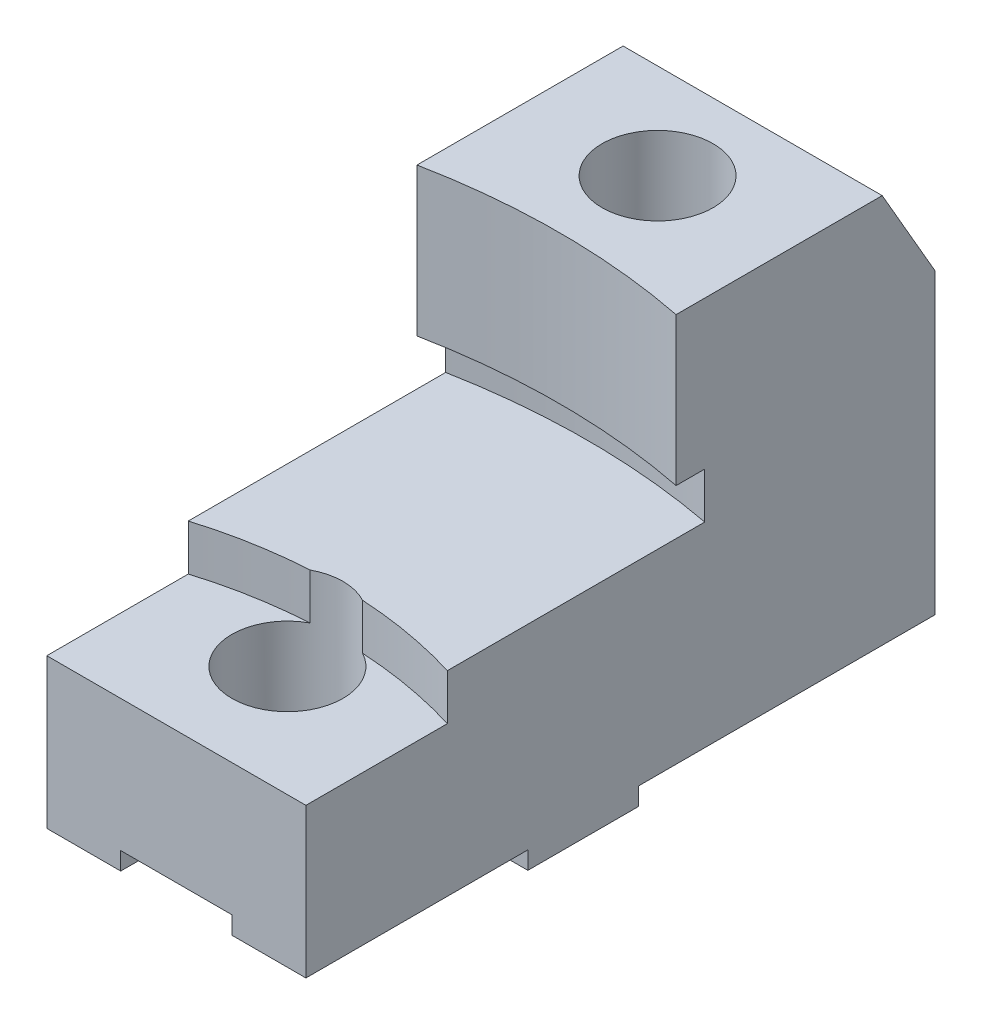
ISO-10303-21;
HEADER;
FILE_DESCRIPTION(('STEP AP214'),'2;1');
FILE_NAME('part.step','',(''),(''),'','','');
FILE_SCHEMA(('AUTOMOTIVE_DESIGN { 1 0 10303 214 1 1 1 1 }'));
ENDSEC;
DATA;
#1=APPLICATION_CONTEXT('core data for automotive mechanical design processes');
#2=APPLICATION_PROTOCOL_DEFINITION('international standard','automotive_design',2000,#1);
#3=PRODUCT_CONTEXT('',#1,'mechanical');
#4=PRODUCT('Part','Part','',(#3));
#5=PRODUCT_RELATED_PRODUCT_CATEGORY('part','',(#4));
#6=PRODUCT_DEFINITION_FORMATION('','',#4);
#7=PRODUCT_DEFINITION_CONTEXT('part definition',#1,'design');
#8=PRODUCT_DEFINITION('design','',#6,#7);
#9=PRODUCT_DEFINITION_SHAPE('','',#8);
#10=(LENGTH_UNIT() NAMED_UNIT(*) SI_UNIT(.MILLI.,.METRE.));
#11=(NAMED_UNIT(*) PLANE_ANGLE_UNIT() SI_UNIT($,.RADIAN.));
#12=(NAMED_UNIT(*) SI_UNIT($,.STERADIAN.) SOLID_ANGLE_UNIT());
#13=UNCERTAINTY_MEASURE_WITH_UNIT(LENGTH_MEASURE(1.E-05),#10,'distance_accuracy_value','');
#14=(GEOMETRIC_REPRESENTATION_CONTEXT(3) GLOBAL_UNCERTAINTY_ASSIGNED_CONTEXT((#13)) GLOBAL_UNIT_ASSIGNED_CONTEXT((#10,
#11,#12)) REPRESENTATION_CONTEXT('',''));
#15=CARTESIAN_POINT('',(0.,0.,0.));
#16=DIRECTION('',(0.,0.,1.));
#17=DIRECTION('',(1.,0.,0.));
#18=AXIS2_PLACEMENT_3D('',#15,#16,#17);
#19=CARTESIAN_POINT('',(-0.587019268774248,1.13,3.99193187619467));
#20=DIRECTION('',(0.,1.,0.));
#21=DIRECTION('',(0.,0.,1.));
#22=AXIS2_PLACEMENT_3D('',#19,#20,#21);
#23=CYLINDRICAL_SURFACE('',#22,3.);
#24=DIRECTION('',(0.,1.,0.));
#25=VECTOR('',#24,1.);
#26=CARTESIAN_POINT('',(-0.763885676302914,1.535,0.997150035410954));
#27=LINE('',#26,#25);
#28=CARTESIAN_POINT('',(-0.763885676302913,1.44,0.997150035410953));
#29=VERTEX_POINT('',#28);
#30=CARTESIAN_POINT('',(-0.763885676302914,1.13,0.997150035410953));
#31=VERTEX_POINT('',#30);
#32=EDGE_CURVE('E48',#29,#31,#27,.F.);
#33=ORIENTED_EDGE('',*,*,#32,.F.);
#34=CARTESIAN_POINT('',(-0.587019268774248,1.44,3.99193187619467));
#35=DIRECTION('',(0.,1.,0.));
#36=DIRECTION('',(0.,0.,1.));
#37=AXIS2_PLACEMENT_3D('',#34,#35,#36);
#38=CIRCLE('',#37,3.);
#39=CARTESIAN_POINT('',(-1.46201926877425,1.44,1.12237180538242));
#40=VERTEX_POINT('',#39);
#41=EDGE_CURVE('E465',#40,#29,#38,.F.);
#42=ORIENTED_EDGE('',*,*,#41,.F.);
#43=DIRECTION('',(0.,1.,0.));
#44=VECTOR('',#43,1.);
#45=CARTESIAN_POINT('',(-1.46201926877425,1.13,1.12237180538242));
#46=LINE('',#45,#44);
#47=CARTESIAN_POINT('',(-1.46201926877425,1.13,1.12237180538242));
#48=VERTEX_POINT('',#47);
#49=EDGE_CURVE('E402',#48,#40,#46,.T.);
#50=ORIENTED_EDGE('',*,*,#49,.F.);
#51=CARTESIAN_POINT('',(-0.587019268774248,1.13,3.99193187619467));
#52=DIRECTION('',(0.,1.,0.));
#53=DIRECTION('',(0.,0.,1.));
#54=AXIS2_PLACEMENT_3D('',#51,#52,#53);
#55=CIRCLE('',#54,3.);
#56=EDGE_CURVE('E404',#48,#31,#55,.F.);
#57=ORIENTED_EDGE('',*,*,#56,.T.);
#58=EDGE_LOOP('',(#33,#42,#50,#57));
#59=FACE_BOUND('',#58,.T.);
#60=ADVANCED_FACE('F26',(#59),#23,.F.);
#61=CARTESIAN_POINT('',(-1.46201926877425,2.75,-2.17217901955773));
#62=DIRECTION('',(1.,0.,0.));
#63=DIRECTION('',(0.,0.,-1.));
#64=AXIS2_PLACEMENT_3D('',#61,#62,#63);
#65=PLANE('',#64);
#66=DIRECTION('',(0.,0.,1.));
#67=VECTOR('',#66,1.);
#68=CARTESIAN_POINT('',(-1.46201926877425,2.75,-2.17217901955773));
#69=LINE('',#68,#67);
#70=CARTESIAN_POINT('',(-1.46201926877425,2.75,-1.81422185266017));
#71=VERTEX_POINT('',#70);
#72=CARTESIAN_POINT('',(-1.46201926877425,2.75,-0.42217901955773));
#73=VERTEX_POINT('',#72);
#74=EDGE_CURVE('E205',#71,#73,#69,.T.);
#75=ORIENTED_EDGE('',*,*,#74,.F.);
#76=DIRECTION('',(0.,0.866025403784442,0.499999999999995));
#77=VECTOR('',#76,1.);
#78=CARTESIAN_POINT('',(-1.46201926877425,-1.96376111831199,-4.53571310321315));
#79=LINE('',#78,#77);
#80=CARTESIAN_POINT('',(-1.46201926877425,2.13,-2.17217901955773));
#81=VERTEX_POINT('',#80);
#82=EDGE_CURVE('E41',#81,#71,#79,.T.);
#83=ORIENTED_EDGE('',*,*,#82,.F.);
#84=DIRECTION('',(0.,-1.,0.));
#85=VECTOR('',#84,1.);
#86=CARTESIAN_POINT('',(-1.46201926877425,2.75,-2.17217901955773));
#87=LINE('',#86,#85);
#88=CARTESIAN_POINT('',(-1.46201926877425,0.12,-2.17217901955773));
#89=VERTEX_POINT('',#88);
#90=EDGE_CURVE('E202',#81,#89,#87,.T.);
#91=ORIENTED_EDGE('',*,*,#90,.T.);
#92=DIRECTION('',(0.,0.,-1.));
#93=VECTOR('',#92,1.);
#94=CARTESIAN_POINT('',(-1.46201926877425,0.12,-2.17217901955773));
#95=LINE('',#94,#93);
#96=CARTESIAN_POINT('',(-1.46201926877425,0.12,-0.16967901955773));
#97=VERTEX_POINT('',#96);
#98=EDGE_CURVE('E272',#97,#89,#95,.T.);
#99=ORIENTED_EDGE('',*,*,#98,.F.);
#100=DIRECTION('',(0.,1.,0.));
#101=VECTOR('',#100,1.);
#102=CARTESIAN_POINT('',(-1.46201926877425,0.12,-0.16967901955773));
#103=LINE('',#102,#101);
#104=CARTESIAN_POINT('',(-1.46201926877425,0.,-0.16967901955773));
#105=VERTEX_POINT('',#104);
#106=EDGE_CURVE('E269',#105,#97,#103,.T.);
#107=ORIENTED_EDGE('',*,*,#106,.F.);
#108=DIRECTION('',(0.,0.,1.));
#109=VECTOR('',#108,1.);
#110=CARTESIAN_POINT('',(-1.46201926877425,0.,-2.17217901955773));
#111=LINE('',#110,#109);
#112=CARTESIAN_POINT('',(-1.46201926877425,0.,0.57882098044227));
#113=VERTEX_POINT('',#112);
#114=EDGE_CURVE('E287',#105,#113,#111,.T.);
#115=ORIENTED_EDGE('',*,*,#114,.T.);
#116=DIRECTION('',(0.,-1.,0.));
#117=VECTOR('',#116,1.);
#118=CARTESIAN_POINT('',(-1.46201926877425,0.12,0.57882098044227));
#119=LINE('',#118,#117);
#120=CARTESIAN_POINT('',(-1.46201926877425,0.12,0.57882098044227));
#121=VERTEX_POINT('',#120);
#122=EDGE_CURVE('E361',#121,#113,#119,.T.);
#123=ORIENTED_EDGE('',*,*,#122,.F.);
#124=DIRECTION('',(0.,0.,-1.));
#125=VECTOR('',#124,1.);
#126=CARTESIAN_POINT('',(-1.46201926877425,0.12,0.57882098044227));
#127=LINE('',#126,#125);
#128=CARTESIAN_POINT('',(-1.46201926877425,0.12,2.07782098044227));
#129=VERTEX_POINT('',#128);
#130=EDGE_CURVE('E254',#129,#121,#127,.T.);
#131=ORIENTED_EDGE('',*,*,#130,.F.);
#132=DIRECTION('',(0.,-1.,0.));
#133=VECTOR('',#132,1.);
#134=CARTESIAN_POINT('',(-1.46201926877425,2.75,2.07782098044227));
#135=LINE('',#134,#133);
#136=CARTESIAN_POINT('',(-1.46201926877425,1.13,2.07782098044227));
#137=VERTEX_POINT('',#136);
#138=EDGE_CURVE('E222',#137,#129,#135,.T.);
#139=ORIENTED_EDGE('',*,*,#138,.F.);
#140=DIRECTION('',(0.,0.,-1.));
#141=VECTOR('',#140,1.);
#142=CARTESIAN_POINT('',(-1.46201926877425,1.13,0.689876428318467));
#143=LINE('',#142,#141);
#144=EDGE_CURVE('E400',#137,#48,#143,.T.);
#145=ORIENTED_EDGE('',*,*,#144,.T.);
#146=ORIENTED_EDGE('',*,*,#49,.T.);
#147=DIRECTION('',(0.,0.,-1.));
#148=VECTOR('',#147,1.);
#149=CARTESIAN_POINT('',(-1.46201926877425,1.44,-3.76360037579504));
#150=LINE('',#149,#148);
#151=CARTESIAN_POINT('',(-1.46201926877425,1.44,-0.615722082166358));
#152=VERTEX_POINT('',#151);
#153=EDGE_CURVE('E315',#40,#152,#150,.T.);
#154=ORIENTED_EDGE('',*,*,#153,.T.);
#155=DIRECTION('',(0.,1.,0.));
#156=VECTOR('',#155,1.);
#157=CARTESIAN_POINT('',(-1.46201926877425,1.44,-0.615722082166358));
#158=LINE('',#157,#156);
#159=CARTESIAN_POINT('',(-1.46201926877425,1.75,-0.615722082166358));
#160=VERTEX_POINT('',#159);
#161=EDGE_CURVE('E317',#152,#160,#158,.T.);
#162=ORIENTED_EDGE('',*,*,#161,.T.);
#163=DIRECTION('',(0.,0.,1.));
#164=VECTOR('',#163,1.);
#165=CARTESIAN_POINT('',(-1.46201926877425,1.75,-0.615722082166358));
#166=LINE('',#165,#164);
#167=CARTESIAN_POINT('',(-1.46201926877425,1.75,-0.42217901955773));
#168=VERTEX_POINT('',#167);
#169=EDGE_CURVE('E303',#160,#168,#166,.T.);
#170=ORIENTED_EDGE('',*,*,#169,.T.);
#171=DIRECTION('',(0.,1.,0.));
#172=VECTOR('',#171,1.);
#173=CARTESIAN_POINT('',(-1.46201926877425,1.44,-0.42217901955773));
#174=LINE('',#173,#172);
#175=EDGE_CURVE('E301',#168,#73,#174,.T.);
#176=ORIENTED_EDGE('',*,*,#175,.T.);
#177=EDGE_LOOP('',(#75,#83,#91,#99,#107,#115,#123,#131,#139,#145,#146,#154,#162,#170,#176));
#178=FACE_BOUND('',#177,.T.);
#179=ADVANCED_FACE('F28',(#178),#65,.F.);
#180=CARTESIAN_POINT('',(-1.46201926877425,2.75,2.07782098044227));
#181=DIRECTION('',(0.,0.,-1.));
#182=DIRECTION('',(-1.,0.,0.));
#183=AXIS2_PLACEMENT_3D('',#180,#181,#182);
#184=PLANE('',#183);
#185=DIRECTION('',(-1.,0.,0.));
#186=VECTOR('',#185,1.);
#187=CARTESIAN_POINT('',(-3.28082705599017,1.13,2.07782098044227));
#188=LINE('',#187,#186);
#189=CARTESIAN_POINT('',(0.287980731225752,1.13,2.07782098044227));
#190=VERTEX_POINT('',#189);
#191=EDGE_CURVE('E398',#190,#137,#188,.T.);
#192=ORIENTED_EDGE('',*,*,#191,.T.);
#193=ORIENTED_EDGE('',*,*,#138,.T.);
#194=DIRECTION('',(-1.,0.,0.));
#195=VECTOR('',#194,1.);
#196=CARTESIAN_POINT('',(1.28798073122575,0.12,2.07782098044227));
#197=LINE('',#196,#195);
#198=CARTESIAN_POINT('',(-0.962769268774248,0.12,2.07782098044227));
#199=VERTEX_POINT('',#198);
#200=EDGE_CURVE('E262',#199,#129,#197,.T.);
#201=ORIENTED_EDGE('',*,*,#200,.F.);
#202=DIRECTION('',(0.,-1.,0.));
#203=VECTOR('',#202,1.);
#204=CARTESIAN_POINT('',(-0.962769268774248,0.24,2.07782098044227));
#205=LINE('',#204,#203);
#206=CARTESIAN_POINT('',(-0.962769268774248,0.24,2.07782098044227));
#207=VERTEX_POINT('',#206);
#208=EDGE_CURVE('E306',#207,#199,#205,.T.);
#209=ORIENTED_EDGE('',*,*,#208,.F.);
#210=DIRECTION('',(-1.,0.,0.));
#211=VECTOR('',#210,1.);
#212=CARTESIAN_POINT('',(-0.962769268774248,0.24,2.07782098044227));
#213=LINE('',#212,#211);
#214=CARTESIAN_POINT('',(-0.211269268774247,0.24,2.07782098044227));
#215=VERTEX_POINT('',#214);
#216=EDGE_CURVE('E326',#215,#207,#213,.T.);
#217=ORIENTED_EDGE('',*,*,#216,.F.);
#218=DIRECTION('',(0.,1.,0.));
#219=VECTOR('',#218,1.);
#220=CARTESIAN_POINT('',(-0.211269268774247,0.24,2.07782098044227));
#221=LINE('',#220,#219);
#222=CARTESIAN_POINT('',(-0.211269268774247,0.12,2.07782098044227));
#223=VERTEX_POINT('',#222);
#224=EDGE_CURVE('E324',#223,#215,#221,.T.);
#225=ORIENTED_EDGE('',*,*,#224,.F.);
#226=CARTESIAN_POINT('',(0.287980731225752,0.12,2.07782098044227));
#227=VERTEX_POINT('',#226);
#228=EDGE_CURVE('E257',#227,#223,#197,.T.);
#229=ORIENTED_EDGE('',*,*,#228,.F.);
#230=DIRECTION('',(0.,-1.,0.));
#231=VECTOR('',#230,1.);
#232=CARTESIAN_POINT('',(0.287980731225752,2.75,2.07782098044227));
#233=LINE('',#232,#231);
#234=EDGE_CURVE('E215',#190,#227,#233,.T.);
#235=ORIENTED_EDGE('',*,*,#234,.F.);
#236=EDGE_LOOP('',(#192,#193,#201,#209,#217,#225,#229,#235));
#237=FACE_BOUND('',#236,.T.);
#238=ADVANCED_FACE('F382',(#237),#184,.F.);
#239=CARTESIAN_POINT('',(0.287980731225752,2.75,-2.17217901955773));
#240=DIRECTION('',(-1.,0.,0.));
#241=DIRECTION('',(0.,0.,1.));
#242=AXIS2_PLACEMENT_3D('',#239,#240,#241);
#243=PLANE('',#242);
#244=DIRECTION('',(0.,-1.,0.));
#245=VECTOR('',#244,1.);
#246=CARTESIAN_POINT('',(0.287980731225752,2.75,-2.17217901955773));
#247=LINE('',#246,#245);
#248=CARTESIAN_POINT('',(0.287980731225752,2.13,-2.17217901955773));
#249=VERTEX_POINT('',#248);
#250=CARTESIAN_POINT('',(0.287980731225752,0.12,-2.17217901955773));
#251=VERTEX_POINT('',#250);
#252=EDGE_CURVE('E212',#249,#251,#247,.T.);
#253=ORIENTED_EDGE('',*,*,#252,.F.);
#254=DIRECTION('',(0.,0.866025403784442,0.499999999999995));
#255=VECTOR('',#254,1.);
#256=CARTESIAN_POINT('',(0.287980731225752,-1.96376111831199,-4.53571310321315));
#257=LINE('',#256,#255);
#258=CARTESIAN_POINT('',(0.287980731225752,2.75,-1.81422185266017));
#259=VERTEX_POINT('',#258);
#260=EDGE_CURVE('E193',#249,#259,#257,.T.);
#261=ORIENTED_EDGE('',*,*,#260,.T.);
#262=DIRECTION('',(0.,0.,-1.));
#263=VECTOR('',#262,1.);
#264=CARTESIAN_POINT('',(0.287980731225752,2.75,-2.17217901955773));
#265=LINE('',#264,#263);
#266=CARTESIAN_POINT('',(0.287980731225752,2.75,-0.42217901955773));
#267=VERTEX_POINT('',#266);
#268=EDGE_CURVE('E213',#267,#259,#265,.T.);
#269=ORIENTED_EDGE('',*,*,#268,.F.);
#270=DIRECTION('',(0.,1.,0.));
#271=VECTOR('',#270,1.);
#272=CARTESIAN_POINT('',(0.287980731225752,1.44,-0.42217901955773));
#273=LINE('',#272,#271);
#274=CARTESIAN_POINT('',(0.287980731225751,1.75,-0.422179019557729));
#275=VERTEX_POINT('',#274);
#276=EDGE_CURVE('E307',#275,#267,#273,.T.);
#277=ORIENTED_EDGE('',*,*,#276,.F.);
#278=DIRECTION('',(0.,0.,-1.));
#279=VECTOR('',#278,1.);
#280=CARTESIAN_POINT('',(0.287980731225752,1.75,-0.615722082166359));
#281=LINE('',#280,#279);
#282=CARTESIAN_POINT('',(0.287980731225752,1.75,-0.615722082166359));
#283=VERTEX_POINT('',#282);
#284=EDGE_CURVE('E419',#275,#283,#281,.T.);
#285=ORIENTED_EDGE('',*,*,#284,.T.);
#286=DIRECTION('',(0.,1.,0.));
#287=VECTOR('',#286,1.);
#288=CARTESIAN_POINT('',(0.287980731225752,1.44,-0.615722082166359));
#289=LINE('',#288,#287);
#290=CARTESIAN_POINT('',(0.287980731225752,1.44,-0.615722082166359));
#291=VERTEX_POINT('',#290);
#292=EDGE_CURVE('E312',#291,#283,#289,.T.);
#293=ORIENTED_EDGE('',*,*,#292,.F.);
#294=DIRECTION('',(0.,0.,1.));
#295=VECTOR('',#294,1.);
#296=CARTESIAN_POINT('',(0.287980731225752,1.44,-3.76360037579504));
#297=LINE('',#296,#295);
#298=CARTESIAN_POINT('',(0.287980731225752,1.44,1.12237180538242));
#299=VERTEX_POINT('',#298);
#300=EDGE_CURVE('E311',#291,#299,#297,.T.);
#301=ORIENTED_EDGE('',*,*,#300,.T.);
#302=DIRECTION('',(0.,1.,0.));
#303=VECTOR('',#302,1.);
#304=CARTESIAN_POINT('',(0.287980731225752,1.13,1.12237180538242));
#305=LINE('',#304,#303);
#306=CARTESIAN_POINT('',(0.287980731225752,1.13,1.12237180538242));
#307=VERTEX_POINT('',#306);
#308=EDGE_CURVE('E408',#307,#299,#305,.T.);
#309=ORIENTED_EDGE('',*,*,#308,.F.);
#310=DIRECTION('',(0.,0.,1.));
#311=VECTOR('',#310,1.);
#312=CARTESIAN_POINT('',(0.287980731225752,1.13,0.689876428318467));
#313=LINE('',#312,#311);
#314=EDGE_CURVE('E397',#307,#190,#313,.T.);
#315=ORIENTED_EDGE('',*,*,#314,.T.);
#316=ORIENTED_EDGE('',*,*,#234,.T.);
#317=DIRECTION('',(0.,0.,-1.));
#318=VECTOR('',#317,1.);
#319=CARTESIAN_POINT('',(0.287980731225752,0.12,-2.17217901955773));
#320=LINE('',#319,#318);
#321=CARTESIAN_POINT('',(0.287980731225752,0.12,0.57882098044227));
#322=VERTEX_POINT('',#321);
#323=EDGE_CURVE('E232',#227,#322,#320,.T.);
#324=ORIENTED_EDGE('',*,*,#323,.T.);
#325=DIRECTION('',(0.,-1.,0.));
#326=VECTOR('',#325,1.);
#327=CARTESIAN_POINT('',(0.287980731225752,2.75,0.57882098044227));
#328=LINE('',#327,#326);
#329=CARTESIAN_POINT('',(0.287980731225752,0.,0.57882098044227));
#330=VERTEX_POINT('',#329);
#331=EDGE_CURVE('E260',#322,#330,#328,.T.);
#332=ORIENTED_EDGE('',*,*,#331,.T.);
#333=DIRECTION('',(0.,0.,-1.));
#334=VECTOR('',#333,1.);
#335=CARTESIAN_POINT('',(0.287980731225752,0.,-2.17217901955773));
#336=LINE('',#335,#334);
#337=CARTESIAN_POINT('',(0.287980731225752,0.,-0.16967901955773));
#338=VERTEX_POINT('',#337);
#339=EDGE_CURVE('E290',#330,#338,#336,.T.);
#340=ORIENTED_EDGE('',*,*,#339,.T.);
#341=DIRECTION('',(0.,1.,0.));
#342=VECTOR('',#341,1.);
#343=CARTESIAN_POINT('',(0.287980731225752,2.75,-0.16967901955773));
#344=LINE('',#343,#342);
#345=CARTESIAN_POINT('',(0.287980731225752,0.12,-0.16967901955773));
#346=VERTEX_POINT('',#345);
#347=EDGE_CURVE('E278',#338,#346,#344,.T.);
#348=ORIENTED_EDGE('',*,*,#347,.T.);
#349=DIRECTION('',(0.,0.,-1.));
#350=VECTOR('',#349,1.);
#351=CARTESIAN_POINT('',(0.287980731225752,0.12,-2.17217901955773));
#352=LINE('',#351,#350);
#353=EDGE_CURVE('E284',#346,#251,#352,.T.);
#354=ORIENTED_EDGE('',*,*,#353,.T.);
#355=EDGE_LOOP('',(#253,#261,#269,#277,#285,#293,#301,#309,#315,#316,#324,#332,#340,#348,#354));
#356=FACE_BOUND('',#355,.T.);
#357=ADVANCED_FACE('F392',(#356),#243,.F.);
#358=CARTESIAN_POINT('',(-0.587019268774248,1.44,-3.76360037579504));
#359=DIRECTION('',(0.,-1.,0.));
#360=DIRECTION('',(0.,0.,-1.));
#361=AXIS2_PLACEMENT_3D('',#358,#359,#360);
#362=PLANE('',#361);
#363=ORIENTED_EDGE('',*,*,#41,.T.);
#364=CARTESIAN_POINT('',(-0.587019268774248,1.44,1.32782098044227));
#365=DIRECTION('',(0.,-1.,0.));
#366=DIRECTION('',(0.,0.,-1.));
#367=AXIS2_PLACEMENT_3D('',#364,#365,#366);
#368=CIRCLE('',#367,0.375);
#369=CARTESIAN_POINT('',(-0.410152861245582,1.44,0.997150035410953));
#370=VERTEX_POINT('',#369);
#371=EDGE_CURVE('E461',#29,#370,#368,.T.);
#372=ORIENTED_EDGE('',*,*,#371,.T.);
#373=EDGE_CURVE('E464',#370,#299,#38,.F.);
#374=ORIENTED_EDGE('',*,*,#373,.T.);
#375=ORIENTED_EDGE('',*,*,#300,.F.);
#376=CARTESIAN_POINT('',(-0.587019268774248,1.44,3.99193187619466));
#377=DIRECTION('',(0.,1.,0.));
#378=DIRECTION('',(0.,0.,-1.));
#379=AXIS2_PLACEMENT_3D('',#376,#377,#378);
#380=CIRCLE('',#379,4.69);
#381=EDGE_CURVE('E422',#291,#152,#380,.T.);
#382=ORIENTED_EDGE('',*,*,#381,.T.);
#383=ORIENTED_EDGE('',*,*,#153,.F.);
#384=EDGE_LOOP('',(#363,#372,#374,#375,#382,#383));
#385=FACE_BOUND('',#384,.T.);
#386=ADVANCED_FACE('F477',(#385),#362,.F.);
#387=CARTESIAN_POINT('',(-0.587019268774248,1.44,3.99193187619466));
#388=DIRECTION('',(0.,1.,0.));
#389=DIRECTION('',(0.,0.,1.));
#390=AXIS2_PLACEMENT_3D('',#387,#388,#389);
#391=CYLINDRICAL_SURFACE('',#390,4.5);
#392=CARTESIAN_POINT('',(-0.587019268774248,1.75,3.99193187619485));
#393=DIRECTION('',(0.,-1.,0.));
#394=DIRECTION('',(0.,0.,-1.));
#395=AXIS2_PLACEMENT_3D('',#392,#393,#394);
#396=CIRCLE('',#395,4.50000000000018);
#397=EDGE_CURVE('E417',#168,#275,#396,.T.);
#398=ORIENTED_EDGE('',*,*,#397,.T.);
#399=ORIENTED_EDGE('',*,*,#276,.T.);
#400=CARTESIAN_POINT('',(-0.587019268774248,2.75,3.99193187619466));
#401=DIRECTION('',(0.,-1.,0.));
#402=DIRECTION('',(0.,0.,-1.));
#403=AXIS2_PLACEMENT_3D('',#400,#401,#402);
#404=CIRCLE('',#403,4.5);
#405=EDGE_CURVE('E297',#267,#73,#404,.F.);
#406=ORIENTED_EDGE('',*,*,#405,.T.);
#407=ORIENTED_EDGE('',*,*,#175,.F.);
#408=EDGE_LOOP('',(#398,#399,#406,#407));
#409=FACE_BOUND('',#408,.T.);
#410=ADVANCED_FACE('F309',(#409),#391,.F.);
#411=CARTESIAN_POINT('',(-1.46201926877425,0.,2.07782098044227));
#412=DIRECTION('',(0.,1.,0.));
#413=DIRECTION('',(0.,0.,1.));
#414=AXIS2_PLACEMENT_3D('',#411,#412,#413);
#415=PLANE('',#414);
#416=DIRECTION('',(1.,0.,0.));
#417=VECTOR('',#416,1.);
#418=CARTESIAN_POINT('',(-1.46201926877425,0.,-0.16967901955773));
#419=LINE('',#418,#417);
#420=CARTESIAN_POINT('',(-0.962769268774248,0.,-0.16967901955773));
#421=VERTEX_POINT('',#420);
#422=EDGE_CURVE('E225',#105,#421,#419,.T.);
#423=ORIENTED_EDGE('',*,*,#422,.T.);
#424=DIRECTION('',(0.,0.,1.));
#425=VECTOR('',#424,1.);
#426=CARTESIAN_POINT('',(-0.962769268774248,0.,-2.17217901955773));
#427=LINE('',#426,#425);
#428=CARTESIAN_POINT('',(-0.962769268774248,0.,0.57882098044227));
#429=VERTEX_POINT('',#428);
#430=EDGE_CURVE('E337',#421,#429,#427,.T.);
#431=ORIENTED_EDGE('',*,*,#430,.T.);
#432=DIRECTION('',(-1.,0.,0.));
#433=VECTOR('',#432,1.);
#434=CARTESIAN_POINT('',(-1.46201926877425,0.,0.57882098044227));
#435=LINE('',#434,#433);
#436=EDGE_CURVE('E228',#429,#113,#435,.T.);
#437=ORIENTED_EDGE('',*,*,#436,.T.);
#438=ORIENTED_EDGE('',*,*,#114,.F.);
#439=EDGE_LOOP('',(#423,#431,#437,#438));
#440=FACE_BOUND('',#439,.T.);
#441=ADVANCED_FACE('F369',(#440),#415,.F.);
#442=CARTESIAN_POINT('',(1.28798073122575,0.12,-2.17217901955773));
#443=DIRECTION('',(0.,1.,0.));
#444=DIRECTION('',(0.,0.,1.));
#445=AXIS2_PLACEMENT_3D('',#442,#443,#444);
#446=PLANE('',#445);
#447=DIRECTION('',(-1.,0.,0.));
#448=VECTOR('',#447,1.);
#449=CARTESIAN_POINT('',(1.28798073122575,0.12,-2.17217901955773));
#450=LINE('',#449,#448);
#451=CARTESIAN_POINT('',(-0.962769268774248,0.12,-2.17217901955773));
#452=VERTEX_POINT('',#451);
#453=EDGE_CURVE('E210',#452,#89,#450,.T.);
#454=ORIENTED_EDGE('',*,*,#453,.F.);
#455=DIRECTION('',(0.,0.,1.));
#456=VECTOR('',#455,1.);
#457=CARTESIAN_POINT('',(-0.962769268774247,0.12,-2.17217901955773));
#458=LINE('',#457,#456);
#459=CARTESIAN_POINT('',(-0.962769268774247,0.12,-0.16967901955773));
#460=VERTEX_POINT('',#459);
#461=EDGE_CURVE('E359',#452,#460,#458,.T.);
#462=ORIENTED_EDGE('',*,*,#461,.T.);
#463=DIRECTION('',(-1.,0.,0.));
#464=VECTOR('',#463,1.);
#465=CARTESIAN_POINT('',(1.28798073122575,0.12,-0.16967901955773));
#466=LINE('',#465,#464);
#467=EDGE_CURVE('E274',#460,#97,#466,.T.);
#468=ORIENTED_EDGE('',*,*,#467,.T.);
#469=ORIENTED_EDGE('',*,*,#98,.T.);
#470=EDGE_LOOP('',(#454,#462,#468,#469));
#471=FACE_BOUND('',#470,.T.);
#472=ADVANCED_FACE('F376',(#471),#446,.F.);
#473=CARTESIAN_POINT('',(1.28798073122575,0.12,-0.16967901955773));
#474=DIRECTION('',(0.,0.,1.));
#475=DIRECTION('',(1.,0.,0.));
#476=AXIS2_PLACEMENT_3D('',#473,#474,#475);
#477=PLANE('',#476);
#478=ORIENTED_EDGE('',*,*,#467,.F.);
#479=DIRECTION('',(0.,-1.,0.));
#480=VECTOR('',#479,1.);
#481=CARTESIAN_POINT('',(-0.962769268774247,0.12,-0.16967901955773));
#482=LINE('',#481,#480);
#483=EDGE_CURVE('E356',#460,#421,#482,.T.);
#484=ORIENTED_EDGE('',*,*,#483,.T.);
#485=ORIENTED_EDGE('',*,*,#422,.F.);
#486=ORIENTED_EDGE('',*,*,#106,.T.);
#487=EDGE_LOOP('',(#478,#484,#485,#486));
#488=FACE_BOUND('',#487,.T.);
#489=ADVANCED_FACE('F374',(#488),#477,.F.);
#490=CARTESIAN_POINT('',(1.28798073122575,0.12,0.57882098044227));
#491=DIRECTION('',(0.,1.,0.));
#492=DIRECTION('',(0.,0.,1.));
#493=AXIS2_PLACEMENT_3D('',#490,#491,#492);
#494=PLANE('',#493);
#495=DIRECTION('',(-1.,0.,0.));
#496=VECTOR('',#495,1.);
#497=CARTESIAN_POINT('',(1.28798073122575,0.12,0.57882098044227));
#498=LINE('',#497,#496);
#499=CARTESIAN_POINT('',(-0.962769268774247,0.12,0.57882098044227));
#500=VERTEX_POINT('',#499);
#501=EDGE_CURVE('E243',#500,#121,#498,.T.);
#502=ORIENTED_EDGE('',*,*,#501,.F.);
#503=DIRECTION('',(0.,0.,1.));
#504=VECTOR('',#503,1.);
#505=CARTESIAN_POINT('',(-0.962769268774247,0.12,0.57882098044227));
#506=LINE('',#505,#504);
#507=EDGE_CURVE('E251',#500,#199,#506,.T.);
#508=ORIENTED_EDGE('',*,*,#507,.T.);
#509=ORIENTED_EDGE('',*,*,#200,.T.);
#510=ORIENTED_EDGE('',*,*,#130,.T.);
#511=EDGE_LOOP('',(#502,#508,#509,#510));
#512=FACE_BOUND('',#511,.T.);
#513=ADVANCED_FACE('F249',(#512),#494,.F.);
#514=CARTESIAN_POINT('',(1.28798073122575,0.12,0.57882098044227));
#515=DIRECTION('',(0.,0.,-1.));
#516=DIRECTION('',(-1.,0.,0.));
#517=AXIS2_PLACEMENT_3D('',#514,#515,#516);
#518=PLANE('',#517);
#519=ORIENTED_EDGE('',*,*,#436,.F.);
#520=DIRECTION('',(0.,1.,0.));
#521=VECTOR('',#520,1.);
#522=CARTESIAN_POINT('',(-0.962769268774247,0.12,0.57882098044227));
#523=LINE('',#522,#521);
#524=EDGE_CURVE('E34',#429,#500,#523,.T.);
#525=ORIENTED_EDGE('',*,*,#524,.T.);
#526=ORIENTED_EDGE('',*,*,#501,.T.);
#527=ORIENTED_EDGE('',*,*,#122,.T.);
#528=EDGE_LOOP('',(#519,#525,#526,#527));
#529=FACE_BOUND('',#528,.T.);
#530=ADVANCED_FACE('F241',(#529),#518,.F.);
#531=CARTESIAN_POINT('',(-1.46201926877425,2.75,-2.17217901955773));
#532=DIRECTION('',(0.,0.,1.));
#533=DIRECTION('',(1.,0.,0.));
#534=AXIS2_PLACEMENT_3D('',#531,#532,#533);
#535=PLANE('',#534);
#536=ORIENTED_EDGE('',*,*,#90,.F.);
#537=DIRECTION('',(-1.,0.,0.));
#538=VECTOR('',#537,1.);
#539=CARTESIAN_POINT('',(0.287980731225752,2.13,-2.17217901955773));
#540=LINE('',#539,#538);
#541=EDGE_CURVE('E190',#249,#81,#540,.T.);
#542=ORIENTED_EDGE('',*,*,#541,.F.);
#543=ORIENTED_EDGE('',*,*,#252,.T.);
#544=CARTESIAN_POINT('',(-0.211269268774247,0.12,-2.17217901955773));
#545=VERTEX_POINT('',#544);
#546=EDGE_CURVE('E275',#251,#545,#450,.T.);
#547=ORIENTED_EDGE('',*,*,#546,.T.);
#548=DIRECTION('',(0.,1.,0.));
#549=VECTOR('',#548,1.);
#550=CARTESIAN_POINT('',(-0.211269268774247,0.24,-2.17217901955773));
#551=LINE('',#550,#549);
#552=CARTESIAN_POINT('',(-0.211269268774247,0.24,-2.17217901955773));
#553=VERTEX_POINT('',#552);
#554=EDGE_CURVE('E331',#545,#553,#551,.T.);
#555=ORIENTED_EDGE('',*,*,#554,.T.);
#556=DIRECTION('',(-1.,0.,0.));
#557=VECTOR('',#556,1.);
#558=CARTESIAN_POINT('',(-0.962769268774248,0.24,-2.17217901955773));
#559=LINE('',#558,#557);
#560=CARTESIAN_POINT('',(-0.962769268774248,0.24,-2.17217901955773));
#561=VERTEX_POINT('',#560);
#562=EDGE_CURVE('E334',#553,#561,#559,.T.);
#563=ORIENTED_EDGE('',*,*,#562,.T.);
#564=DIRECTION('',(0.,-1.,0.));
#565=VECTOR('',#564,1.);
#566=CARTESIAN_POINT('',(-0.962769268774248,0.24,-2.17217901955773));
#567=LINE('',#566,#565);
#568=EDGE_CURVE('E329',#561,#452,#567,.T.);
#569=ORIENTED_EDGE('',*,*,#568,.T.);
#570=ORIENTED_EDGE('',*,*,#453,.T.);
#571=EDGE_LOOP('',(#536,#542,#543,#547,#555,#563,#569,#570));
#572=FACE_BOUND('',#571,.T.);
#573=ADVANCED_FACE('F207',(#572),#535,.F.);
#574=CARTESIAN_POINT('',(-1.46201926877425,2.75,2.07782098044227));
#575=DIRECTION('',(0.,1.,0.));
#576=DIRECTION('',(0.,0.,1.));
#577=AXIS2_PLACEMENT_3D('',#574,#575,#576);
#578=PLANE('',#577);
#579=DIRECTION('',(-1.,0.,0.));
#580=VECTOR('',#579,1.);
#581=CARTESIAN_POINT('',(0.287980731225752,2.75,-1.81422185266017));
#582=LINE('',#581,#580);
#583=EDGE_CURVE('E197',#259,#71,#582,.T.);
#584=ORIENTED_EDGE('',*,*,#583,.T.);
#585=ORIENTED_EDGE('',*,*,#74,.T.);
#586=ORIENTED_EDGE('',*,*,#405,.F.);
#587=ORIENTED_EDGE('',*,*,#268,.T.);
#588=EDGE_LOOP('',(#584,#585,#586,#587));
#589=FACE_BOUND('',#588,.T.);
#590=CARTESIAN_POINT('',(-0.587019268774248,2.75,-1.17217901955773));
#591=DIRECTION('',(0.,1.,0.));
#592=DIRECTION('',(0.,0.,1.));
#593=AXIS2_PLACEMENT_3D('',#590,#591,#592);
#594=CIRCLE('',#593,0.375);
#595=CARTESIAN_POINT('',(-0.587019268774248,2.75,-0.79717901955773));
#596=VERTEX_POINT('',#595);
#597=EDGE_CURVE('E443',#596,#596,#594,.T.);
#598=ORIENTED_EDGE('',*,*,#597,.F.);
#599=EDGE_LOOP('',(#598));
#600=FACE_BOUND('',#599,.T.);
#601=ADVANCED_FACE('F294',(#589,#600),#578,.T.);
#602=CARTESIAN_POINT('',(-0.211269268774247,0.,0.57882098044227));
#603=VERTEX_POINT('',#602);
#604=EDGE_CURVE('E229',#330,#603,#435,.T.);
#605=ORIENTED_EDGE('',*,*,#604,.T.);
#606=DIRECTION('',(0.,0.,1.));
#607=VECTOR('',#606,1.);
#608=CARTESIAN_POINT('',(-0.211269268774247,0.,-2.17217901955773));
#609=LINE('',#608,#607);
#610=CARTESIAN_POINT('',(-0.211269268774247,0.,-0.16967901955773));
#611=VERTEX_POINT('',#610);
#612=EDGE_CURVE('E344',#611,#603,#609,.T.);
#613=ORIENTED_EDGE('',*,*,#612,.F.);
#614=EDGE_CURVE('E224',#611,#338,#419,.T.);
#615=ORIENTED_EDGE('',*,*,#614,.T.);
#616=ORIENTED_EDGE('',*,*,#339,.F.);
#617=EDGE_LOOP('',(#605,#613,#615,#616));
#618=FACE_BOUND('',#617,.T.);
#619=ADVANCED_FACE('F519',(#618),#415,.F.);
#620=CARTESIAN_POINT('',(-0.211269268774247,0.12,-0.16967901955773));
#621=VERTEX_POINT('',#620);
#622=EDGE_CURVE('E279',#346,#621,#466,.T.);
#623=ORIENTED_EDGE('',*,*,#622,.T.);
#624=DIRECTION('',(0.,0.,-1.));
#625=VECTOR('',#624,1.);
#626=CARTESIAN_POINT('',(-0.211269268774247,0.12,-2.17217901955773));
#627=LINE('',#626,#625);
#628=EDGE_CURVE('E352',#621,#545,#627,.T.);
#629=ORIENTED_EDGE('',*,*,#628,.T.);
#630=ORIENTED_EDGE('',*,*,#546,.F.);
#631=ORIENTED_EDGE('',*,*,#353,.F.);
#632=EDGE_LOOP('',(#623,#629,#630,#631));
#633=FACE_BOUND('',#632,.T.);
#634=ADVANCED_FACE('F516',(#633),#446,.F.);
#635=ORIENTED_EDGE('',*,*,#614,.F.);
#636=DIRECTION('',(0.,1.,0.));
#637=VECTOR('',#636,1.);
#638=CARTESIAN_POINT('',(-0.211269268774247,0.12,-0.16967901955773));
#639=LINE('',#638,#637);
#640=EDGE_CURVE('E349',#611,#621,#639,.T.);
#641=ORIENTED_EDGE('',*,*,#640,.T.);
#642=ORIENTED_EDGE('',*,*,#622,.F.);
#643=ORIENTED_EDGE('',*,*,#347,.F.);
#644=EDGE_LOOP('',(#635,#641,#642,#643));
#645=FACE_BOUND('',#644,.T.);
#646=ADVANCED_FACE('F512',(#645),#477,.F.);
#647=ORIENTED_EDGE('',*,*,#228,.T.);
#648=DIRECTION('',(0.,0.,-1.));
#649=VECTOR('',#648,1.);
#650=CARTESIAN_POINT('',(-0.211269268774247,0.12,0.57882098044227));
#651=LINE('',#650,#649);
#652=CARTESIAN_POINT('',(-0.211269268774247,0.12,0.57882098044227));
#653=VERTEX_POINT('',#652);
#654=EDGE_CURVE('E340',#223,#653,#651,.T.);
#655=ORIENTED_EDGE('',*,*,#654,.T.);
#656=EDGE_CURVE('E256',#322,#653,#498,.T.);
#657=ORIENTED_EDGE('',*,*,#656,.F.);
#658=ORIENTED_EDGE('',*,*,#323,.F.);
#659=EDGE_LOOP('',(#647,#655,#657,#658));
#660=FACE_BOUND('',#659,.T.);
#661=ADVANCED_FACE('F389',(#660),#494,.F.);
#662=ORIENTED_EDGE('',*,*,#656,.T.);
#663=DIRECTION('',(0.,-1.,0.));
#664=VECTOR('',#663,1.);
#665=CARTESIAN_POINT('',(-0.211269268774247,0.12,0.57882098044227));
#666=LINE('',#665,#664);
#667=EDGE_CURVE('E235',#653,#603,#666,.T.);
#668=ORIENTED_EDGE('',*,*,#667,.T.);
#669=ORIENTED_EDGE('',*,*,#604,.F.);
#670=ORIENTED_EDGE('',*,*,#331,.F.);
#671=EDGE_LOOP('',(#662,#668,#669,#670));
#672=FACE_BOUND('',#671,.T.);
#673=ADVANCED_FACE('F509',(#672),#518,.F.);
#674=CARTESIAN_POINT('',(-0.962769268774248,0.24,-2.17217901955773));
#675=DIRECTION('',(-1.,0.,0.));
#676=DIRECTION('',(0.,0.,1.));
#677=AXIS2_PLACEMENT_3D('',#674,#675,#676);
#678=PLANE('',#677);
#679=ORIENTED_EDGE('',*,*,#568,.F.);
#680=DIRECTION('',(0.,0.,1.));
#681=VECTOR('',#680,1.);
#682=CARTESIAN_POINT('',(-0.962769268774248,0.24,-2.17217901955773));
#683=LINE('',#682,#681);
#684=EDGE_CURVE('E338',#561,#207,#683,.T.);
#685=ORIENTED_EDGE('',*,*,#684,.T.);
#686=ORIENTED_EDGE('',*,*,#208,.T.);
#687=ORIENTED_EDGE('',*,*,#507,.F.);
#688=ORIENTED_EDGE('',*,*,#524,.F.);
#689=ORIENTED_EDGE('',*,*,#430,.F.);
#690=ORIENTED_EDGE('',*,*,#483,.F.);
#691=ORIENTED_EDGE('',*,*,#461,.F.);
#692=EDGE_LOOP('',(#679,#685,#686,#687,#688,#689,#690,#691));
#693=FACE_BOUND('',#692,.T.);
#694=ADVANCED_FACE('F371',(#693),#678,.F.);
#695=CARTESIAN_POINT('',(-0.211269268774247,0.24,-2.17217901955773));
#696=DIRECTION('',(1.,0.,0.));
#697=DIRECTION('',(0.,0.,-1.));
#698=AXIS2_PLACEMENT_3D('',#695,#696,#697);
#699=PLANE('',#698);
#700=ORIENTED_EDGE('',*,*,#640,.F.);
#701=ORIENTED_EDGE('',*,*,#612,.T.);
#702=ORIENTED_EDGE('',*,*,#667,.F.);
#703=ORIENTED_EDGE('',*,*,#654,.F.);
#704=ORIENTED_EDGE('',*,*,#224,.T.);
#705=DIRECTION('',(0.,0.,1.));
#706=VECTOR('',#705,1.);
#707=CARTESIAN_POINT('',(-0.211269268774247,0.24,-2.17217901955773));
#708=LINE('',#707,#706);
#709=EDGE_CURVE('E341',#553,#215,#708,.T.);
#710=ORIENTED_EDGE('',*,*,#709,.F.);
#711=ORIENTED_EDGE('',*,*,#554,.F.);
#712=ORIENTED_EDGE('',*,*,#628,.F.);
#713=EDGE_LOOP('',(#700,#701,#702,#703,#704,#710,#711,#712));
#714=FACE_BOUND('',#713,.T.);
#715=ADVANCED_FACE('F503',(#714),#699,.F.);
#716=CARTESIAN_POINT('',(-0.962769268774248,0.24,-2.17217901955773));
#717=DIRECTION('',(0.,1.,0.));
#718=DIRECTION('',(-1.,0.,0.));
#719=AXIS2_PLACEMENT_3D('',#716,#717,#718);
#720=PLANE('',#719);
#721=CARTESIAN_POINT('',(-0.587019268774248,0.24,-1.17217901955773));
#722=DIRECTION('',(0.,1.,0.));
#723=DIRECTION('',(-1.,0.,0.));
#724=AXIS2_PLACEMENT_3D('',#721,#722,#723);
#725=CIRCLE('',#724,0.25);
#726=CARTESIAN_POINT('',(-0.837019268774248,0.24,-1.17217901955773));
#727=VERTEX_POINT('',#726);
#728=EDGE_CURVE('E440',#727,#727,#725,.T.);
#729=ORIENTED_EDGE('',*,*,#728,.T.);
#730=EDGE_LOOP('',(#729));
#731=FACE_BOUND('',#730,.T.);
#732=CARTESIAN_POINT('',(-0.587019268774248,0.24,1.32782098044227));
#733=DIRECTION('',(0.,1.,0.));
#734=DIRECTION('',(-1.,0.,0.));
#735=AXIS2_PLACEMENT_3D('',#732,#733,#734);
#736=CIRCLE('',#735,0.25);
#737=CARTESIAN_POINT('',(-0.837019268774248,0.24,1.32782098044227));
#738=VERTEX_POINT('',#737);
#739=EDGE_CURVE('E452',#738,#738,#736,.T.);
#740=ORIENTED_EDGE('',*,*,#739,.T.);
#741=EDGE_LOOP('',(#740));
#742=FACE_BOUND('',#741,.T.);
#743=ORIENTED_EDGE('',*,*,#216,.T.);
#744=ORIENTED_EDGE('',*,*,#684,.F.);
#745=ORIENTED_EDGE('',*,*,#562,.F.);
#746=ORIENTED_EDGE('',*,*,#709,.T.);
#747=EDGE_LOOP('',(#743,#744,#745,#746));
#748=FACE_BOUND('',#747,.T.);
#749=ADVANCED_FACE('F379',(#731,#742,#748),#720,.F.);
#750=CARTESIAN_POINT('',(-0.587019268774248,1.44,3.99193187619466));
#751=DIRECTION('',(0.,1.,0.));
#752=DIRECTION('',(0.,0.,1.));
#753=AXIS2_PLACEMENT_3D('',#750,#751,#752);
#754=CYLINDRICAL_SURFACE('',#753,4.69);
#755=CARTESIAN_POINT('',(-0.587019268774248,1.75,3.99193187619466));
#756=DIRECTION('',(0.,1.,0.));
#757=DIRECTION('',(0.,0.,-1.));
#758=AXIS2_PLACEMENT_3D('',#755,#756,#757);
#759=CIRCLE('',#758,4.69);
#760=EDGE_CURVE('E411',#283,#160,#759,.T.);
#761=ORIENTED_EDGE('',*,*,#760,.T.);
#762=ORIENTED_EDGE('',*,*,#161,.F.);
#763=ORIENTED_EDGE('',*,*,#381,.F.);
#764=ORIENTED_EDGE('',*,*,#292,.T.);
#765=EDGE_LOOP('',(#761,#762,#763,#764));
#766=FACE_BOUND('',#765,.T.);
#767=ADVANCED_FACE('F429',(#766),#754,.F.);
#768=CARTESIAN_POINT('',(-0.587019268774248,1.75,3.99193187619466));
#769=DIRECTION('',(0.,-1.,0.));
#770=DIRECTION('',(0.,0.,-1.));
#771=AXIS2_PLACEMENT_3D('',#768,#769,#770);
#772=PLANE('',#771);
#773=ORIENTED_EDGE('',*,*,#760,.F.);
#774=ORIENTED_EDGE('',*,*,#284,.F.);
#775=ORIENTED_EDGE('',*,*,#397,.F.);
#776=ORIENTED_EDGE('',*,*,#169,.F.);
#777=EDGE_LOOP('',(#773,#774,#775,#776));
#778=FACE_BOUND('',#777,.T.);
#779=ADVANCED_FACE('F433',(#778),#772,.T.);
#780=DIRECTION('',(0.,1.,0.));
#781=VECTOR('',#780,1.);
#782=CARTESIAN_POINT('',(-0.410152861245581,1.535,0.997150035410954));
#783=LINE('',#782,#781);
#784=CARTESIAN_POINT('',(-0.410152861245581,1.13,0.997150035410953));
#785=VERTEX_POINT('',#784);
#786=EDGE_CURVE('E458',#785,#370,#783,.T.);
#787=ORIENTED_EDGE('',*,*,#786,.F.);
#788=EDGE_CURVE('E467',#785,#307,#55,.F.);
#789=ORIENTED_EDGE('',*,*,#788,.T.);
#790=ORIENTED_EDGE('',*,*,#308,.T.);
#791=ORIENTED_EDGE('',*,*,#373,.F.);
#792=EDGE_LOOP('',(#787,#789,#790,#791));
#793=FACE_BOUND('',#792,.T.);
#794=ADVANCED_FACE('F474',(#793),#23,.F.);
#795=CARTESIAN_POINT('',(-3.28082705599017,1.13,0.689876428318467));
#796=DIRECTION('',(0.,1.,0.));
#797=DIRECTION('',(0.,0.,1.));
#798=AXIS2_PLACEMENT_3D('',#795,#796,#797);
#799=PLANE('',#798);
#800=CARTESIAN_POINT('',(-0.587019268774248,1.13,1.32782098044227));
#801=DIRECTION('',(0.,1.,0.));
#802=DIRECTION('',(0.,0.,1.));
#803=AXIS2_PLACEMENT_3D('',#800,#801,#802);
#804=CIRCLE('',#803,0.375);
#805=EDGE_CURVE('E11',#31,#785,#804,.T.);
#806=ORIENTED_EDGE('',*,*,#805,.F.);
#807=ORIENTED_EDGE('',*,*,#56,.F.);
#808=ORIENTED_EDGE('',*,*,#144,.F.);
#809=ORIENTED_EDGE('',*,*,#191,.F.);
#810=ORIENTED_EDGE('',*,*,#314,.F.);
#811=ORIENTED_EDGE('',*,*,#788,.F.);
#812=EDGE_LOOP('',(#806,#807,#808,#809,#810,#811));
#813=FACE_BOUND('',#812,.T.);
#814=ADVANCED_FACE('F476',(#813),#799,.T.);
#815=CARTESIAN_POINT('',(-0.587019268774248,0.32,1.32782098044227));
#816=DIRECTION('',(0.,1.,0.));
#817=DIRECTION('',(0.,0.,1.));
#818=AXIS2_PLACEMENT_3D('',#815,#816,#817);
#819=CYLINDRICAL_SURFACE('',#818,0.375);
#820=CARTESIAN_POINT('',(-0.587019268774248,0.32,1.32782098044227));
#821=DIRECTION('',(0.,1.,0.));
#822=DIRECTION('',(0.,0.,1.));
#823=AXIS2_PLACEMENT_3D('',#820,#821,#822);
#824=CIRCLE('',#823,0.375);
#825=CARTESIAN_POINT('',(-0.587019268774248,0.32,1.70282098044227));
#826=VERTEX_POINT('',#825);
#827=EDGE_CURVE('E455',#826,#826,#824,.T.);
#828=ORIENTED_EDGE('',*,*,#827,.F.);
#829=EDGE_LOOP('',(#828));
#830=FACE_BOUND('',#829,.T.);
#831=ORIENTED_EDGE('',*,*,#32,.T.);
#832=ORIENTED_EDGE('',*,*,#805,.T.);
#833=ORIENTED_EDGE('',*,*,#786,.T.);
#834=ORIENTED_EDGE('',*,*,#371,.F.);
#835=EDGE_LOOP('',(#831,#832,#833,#834));
#836=FACE_BOUND('',#835,.T.);
#837=ADVANCED_FACE('F478',(#830,#836),#819,.F.);
#838=CARTESIAN_POINT('',(-0.587019268774248,0.32,1.32782098044227));
#839=DIRECTION('',(0.,1.,0.));
#840=DIRECTION('',(0.,0.,1.));
#841=AXIS2_PLACEMENT_3D('',#838,#839,#840);
#842=PLANE('',#841);
#843=CARTESIAN_POINT('',(-0.587019268774248,0.32,1.32782098044227));
#844=DIRECTION('',(0.,1.,0.));
#845=DIRECTION('',(0.,0.,1.));
#846=AXIS2_PLACEMENT_3D('',#843,#844,#845);
#847=CIRCLE('',#846,0.25);
#848=CARTESIAN_POINT('',(-0.587019268774248,0.32,1.57782098044227));
#849=VERTEX_POINT('',#848);
#850=EDGE_CURVE('E449',#849,#849,#847,.T.);
#851=ORIENTED_EDGE('',*,*,#850,.F.);
#852=EDGE_LOOP('',(#851));
#853=FACE_BOUND('',#852,.T.);
#854=ORIENTED_EDGE('',*,*,#827,.T.);
#855=EDGE_LOOP('',(#854));
#856=FACE_BOUND('',#855,.T.);
#857=ADVANCED_FACE('F558',(#853,#856),#842,.T.);
#858=CARTESIAN_POINT('',(-0.587019268774248,-0.49,1.32782098044227));
#859=DIRECTION('',(0.,1.,0.));
#860=DIRECTION('',(0.,0.,1.));
#861=AXIS2_PLACEMENT_3D('',#858,#859,#860);
#862=CYLINDRICAL_SURFACE('',#861,0.25);
#863=ORIENTED_EDGE('',*,*,#850,.T.);
#864=EDGE_LOOP('',(#863));
#865=FACE_BOUND('',#864,.T.);
#866=ORIENTED_EDGE('',*,*,#739,.F.);
#867=EDGE_LOOP('',(#866));
#868=FACE_BOUND('',#867,.T.);
#869=ADVANCED_FACE('F566',(#865,#868),#862,.F.);
#870=CARTESIAN_POINT('',(-0.587019268774248,1.94,-1.17217901955773));
#871=DIRECTION('',(0.,1.,0.));
#872=DIRECTION('',(0.,0.,1.));
#873=AXIS2_PLACEMENT_3D('',#870,#871,#872);
#874=CYLINDRICAL_SURFACE('',#873,0.375);
#875=CARTESIAN_POINT('',(-0.587019268774248,1.94,-1.17217901955773));
#876=DIRECTION('',(0.,1.,0.));
#877=DIRECTION('',(0.,0.,1.));
#878=AXIS2_PLACEMENT_3D('',#875,#876,#877);
#879=CIRCLE('',#878,0.375);
#880=CARTESIAN_POINT('',(-0.587019268774248,1.94,-0.79717901955773));
#881=VERTEX_POINT('',#880);
#882=EDGE_CURVE('E446',#881,#881,#879,.T.);
#883=ORIENTED_EDGE('',*,*,#882,.F.);
#884=EDGE_LOOP('',(#883));
#885=FACE_BOUND('',#884,.T.);
#886=ORIENTED_EDGE('',*,*,#597,.T.);
#887=EDGE_LOOP('',(#886));
#888=FACE_BOUND('',#887,.T.);
#889=ADVANCED_FACE('F574',(#885,#888),#874,.F.);
#890=CARTESIAN_POINT('',(-0.587019268774248,1.94,-1.17217901955773));
#891=DIRECTION('',(0.,1.,0.));
#892=DIRECTION('',(0.,0.,1.));
#893=AXIS2_PLACEMENT_3D('',#890,#891,#892);
#894=PLANE('',#893);
#895=CARTESIAN_POINT('',(-0.587019268774248,1.94,-1.17217901955773));
#896=DIRECTION('',(0.,1.,0.));
#897=DIRECTION('',(0.,0.,1.));
#898=AXIS2_PLACEMENT_3D('',#895,#896,#897);
#899=CIRCLE('',#898,0.25);
#900=CARTESIAN_POINT('',(-0.587019268774248,1.94,-0.92217901955773));
#901=VERTEX_POINT('',#900);
#902=EDGE_CURVE('E436',#901,#901,#899,.T.);
#903=ORIENTED_EDGE('',*,*,#902,.F.);
#904=EDGE_LOOP('',(#903));
#905=FACE_BOUND('',#904,.T.);
#906=ORIENTED_EDGE('',*,*,#882,.T.);
#907=EDGE_LOOP('',(#906));
#908=FACE_BOUND('',#907,.T.);
#909=ADVANCED_FACE('F582',(#905,#908),#894,.T.);
#910=CARTESIAN_POINT('',(-0.587019268774248,0.,-1.17217901955773));
#911=DIRECTION('',(0.,1.,0.));
#912=DIRECTION('',(0.,0.,1.));
#913=AXIS2_PLACEMENT_3D('',#910,#911,#912);
#914=CYLINDRICAL_SURFACE('',#913,0.25);
#915=ORIENTED_EDGE('',*,*,#902,.T.);
#916=EDGE_LOOP('',(#915));
#917=FACE_BOUND('',#916,.T.);
#918=ORIENTED_EDGE('',*,*,#728,.F.);
#919=EDGE_LOOP('',(#918));
#920=FACE_BOUND('',#919,.T.);
#921=ADVANCED_FACE('F590',(#917,#920),#914,.F.);
#922=CARTESIAN_POINT('',(0.287980731225752,-1.96376111831199,-4.53571310321315));
#923=DIRECTION('',(0.,-0.499999999999995,0.866025403784442));
#924=DIRECTION('',(0.,-0.866025403784442,-0.499999999999995));
#925=AXIS2_PLACEMENT_3D('',#922,#923,#924);
#926=PLANE('',#925);
#927=ORIENTED_EDGE('',*,*,#82,.T.);
#928=ORIENTED_EDGE('',*,*,#583,.F.);
#929=ORIENTED_EDGE('',*,*,#260,.F.);
#930=ORIENTED_EDGE('',*,*,#541,.T.);
#931=EDGE_LOOP('',(#927,#928,#929,#930));
#932=FACE_BOUND('',#931,.T.);
#933=ADVANCED_FACE('F191',(#932),#926,.F.);
#934=CLOSED_SHELL('',(#60,#179,#238,#357,#386,#410,#441,#472,#489,#513,#530,#573,#601,#619,#634,
#646,#661,#673,#694,#715,#749,#767,#779,#794,#814,#837,#857,#869,#889,#909,#921,#933));
#935=MANIFOLD_SOLID_BREP('B2',#934);
#936=ADVANCED_BREP_SHAPE_REPRESENTATION('',(#18,#935),#14);
#937=SHAPE_DEFINITION_REPRESENTATION(#9,#936);
ENDSEC;
END-ISO-10303-21;
